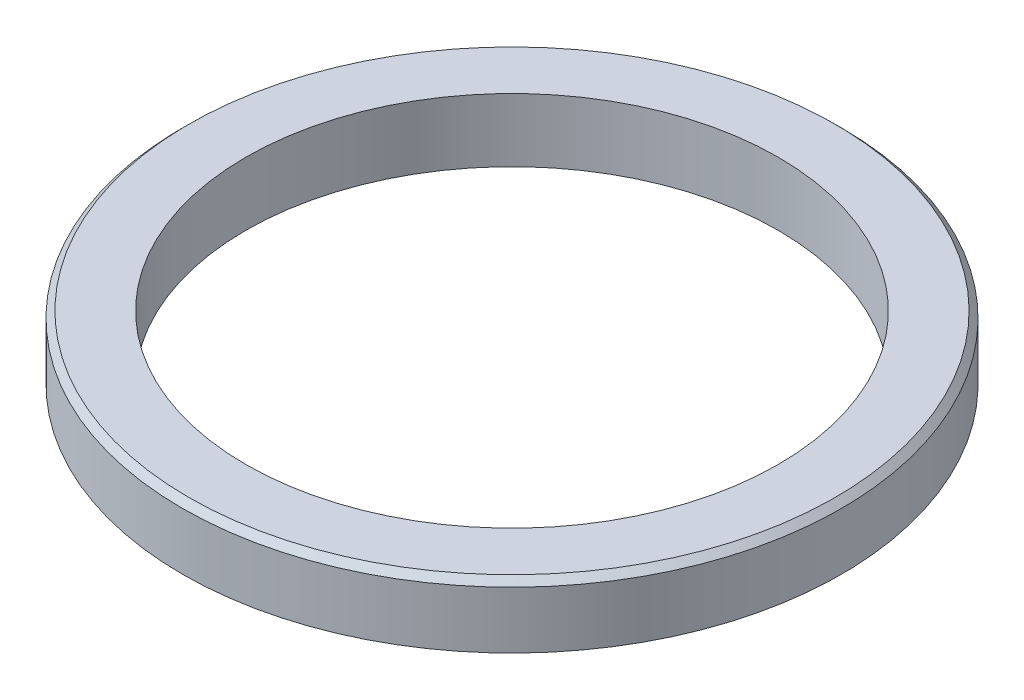
ISO-10303-21;
HEADER;
FILE_DESCRIPTION(('STEP AP214'),'2;1');
FILE_NAME('part.step','',(''),(''),'','','');
FILE_SCHEMA(('AUTOMOTIVE_DESIGN { 1 0 10303 214 1 1 1 1 }'));
ENDSEC;
DATA;
#1=APPLICATION_CONTEXT('core data for automotive mechanical design processes');
#2=APPLICATION_PROTOCOL_DEFINITION('international standard','automotive_design',2000,#1);
#3=PRODUCT_CONTEXT('',#1,'mechanical');
#4=PRODUCT('Part','Part','',(#3));
#5=PRODUCT_RELATED_PRODUCT_CATEGORY('part','',(#4));
#6=PRODUCT_DEFINITION_FORMATION('','',#4);
#7=PRODUCT_DEFINITION_CONTEXT('part definition',#1,'design');
#8=PRODUCT_DEFINITION('design','',#6,#7);
#9=PRODUCT_DEFINITION_SHAPE('','',#8);
#10=(LENGTH_UNIT() NAMED_UNIT(*) SI_UNIT(.MILLI.,.METRE.));
#11=(NAMED_UNIT(*) PLANE_ANGLE_UNIT() SI_UNIT($,.RADIAN.));
#12=(NAMED_UNIT(*) SI_UNIT($,.STERADIAN.) SOLID_ANGLE_UNIT());
#13=UNCERTAINTY_MEASURE_WITH_UNIT(LENGTH_MEASURE(1.E-05),#10,'distance_accuracy_value','');
#14=(GEOMETRIC_REPRESENTATION_CONTEXT(3) GLOBAL_UNCERTAINTY_ASSIGNED_CONTEXT((#13)) GLOBAL_UNIT_ASSIGNED_CONTEXT((#10,
#11,#12)) REPRESENTATION_CONTEXT('',''));
#15=CARTESIAN_POINT('',(0.,0.,0.));
#16=DIRECTION('',(0.,0.,1.));
#17=DIRECTION('',(1.,0.,0.));
#18=AXIS2_PLACEMENT_3D('',#15,#16,#17);
#19=CARTESIAN_POINT('',(0.,5.,0.));
#20=DIRECTION('',(0.,-1.,0.));
#21=DIRECTION('',(0.,0.,-1.));
#22=AXIS2_PLACEMENT_3D('',#19,#20,#21);
#23=CYLINDRICAL_SURFACE('',#22,26.);
#24=CARTESIAN_POINT('',(0.,4.50000000000001,0.));
#25=DIRECTION('',(0.,1.,0.));
#26=DIRECTION('',(0.,0.,1.));
#27=AXIS2_PLACEMENT_3D('',#24,#25,#26);
#28=CIRCLE('',#27,26.);
#29=CARTESIAN_POINT('',(0.,4.50000000000001,26.));
#30=VERTEX_POINT('',#29);
#31=EDGE_CURVE('E10',#30,#30,#28,.F.);
#32=ORIENTED_EDGE('',*,*,#31,.T.);
#33=EDGE_LOOP('',(#32));
#34=FACE_BOUND('',#33,.T.);
#35=CARTESIAN_POINT('',(0.,0.,0.));
#36=DIRECTION('',(0.,1.,0.));
#37=DIRECTION('',(0.,0.,1.));
#38=AXIS2_PLACEMENT_3D('',#35,#36,#37);
#39=CIRCLE('',#38,26.);
#40=CARTESIAN_POINT('',(0.,0.,26.));
#41=VERTEX_POINT('',#40);
#42=EDGE_CURVE('E53',#41,#41,#39,.T.);
#43=ORIENTED_EDGE('',*,*,#42,.T.);
#44=EDGE_LOOP('',(#43));
#45=FACE_BOUND('',#44,.T.);
#46=ADVANCED_FACE('F38',(#34,#45),#23,.T.);
#47=CARTESIAN_POINT('',(0.,5.,0.));
#48=DIRECTION('',(0.,1.,0.));
#49=DIRECTION('',(0.,0.,1.));
#50=AXIS2_PLACEMENT_3D('',#47,#48,#49);
#51=PLANE('',#50);
#52=CARTESIAN_POINT('',(0.,5.,0.));
#53=DIRECTION('',(0.,1.,0.));
#54=DIRECTION('',(0.,0.,1.));
#55=AXIS2_PLACEMENT_3D('',#52,#53,#54);
#56=CIRCLE('',#55,21.);
#57=CARTESIAN_POINT('',(0.,5.,21.));
#58=VERTEX_POINT('',#57);
#59=EDGE_CURVE('E59',#58,#58,#56,.T.);
#60=ORIENTED_EDGE('',*,*,#59,.F.);
#61=EDGE_LOOP('',(#60));
#62=FACE_BOUND('',#61,.T.);
#63=CARTESIAN_POINT('',(0.,5.,0.));
#64=DIRECTION('',(0.,1.,0.));
#65=DIRECTION('',(0.,0.,1.));
#66=AXIS2_PLACEMENT_3D('',#63,#64,#65);
#67=CIRCLE('',#66,25.5);
#68=CARTESIAN_POINT('',(0.,5.,25.5));
#69=VERTEX_POINT('',#68);
#70=EDGE_CURVE('E48',#69,#69,#67,.T.);
#71=ORIENTED_EDGE('',*,*,#70,.T.);
#72=EDGE_LOOP('',(#71));
#73=FACE_BOUND('',#72,.T.);
#74=ADVANCED_FACE('F80',(#62,#73),#51,.T.);
#75=CARTESIAN_POINT('',(0.,0.,0.));
#76=DIRECTION('',(0.,1.,0.));
#77=DIRECTION('',(0.,0.,1.));
#78=AXIS2_PLACEMENT_3D('',#75,#76,#77);
#79=PLANE('',#78);
#80=CARTESIAN_POINT('',(0.,0.,0.));
#81=DIRECTION('',(0.,1.,0.));
#82=DIRECTION('',(0.,0.,1.));
#83=AXIS2_PLACEMENT_3D('',#80,#81,#82);
#84=CIRCLE('',#83,21.);
#85=CARTESIAN_POINT('',(0.,0.,21.));
#86=VERTEX_POINT('',#85);
#87=EDGE_CURVE('E43',#86,#86,#84,.T.);
#88=ORIENTED_EDGE('',*,*,#87,.T.);
#89=EDGE_LOOP('',(#88));
#90=FACE_BOUND('',#89,.T.);
#91=ORIENTED_EDGE('',*,*,#42,.F.);
#92=EDGE_LOOP('',(#91));
#93=FACE_BOUND('',#92,.T.);
#94=ADVANCED_FACE('F68',(#90,#93),#79,.F.);
#95=CARTESIAN_POINT('',(0.,5.,0.));
#96=DIRECTION('',(0.,-1.,0.));
#97=DIRECTION('',(0.,0.,-1.));
#98=AXIS2_PLACEMENT_3D('',#95,#96,#97);
#99=CONICAL_SURFACE('',#98,25.5,0.785398163397452);
#100=ORIENTED_EDGE('',*,*,#31,.F.);
#101=EDGE_LOOP('',(#100));
#102=FACE_BOUND('',#101,.T.);
#103=ORIENTED_EDGE('',*,*,#70,.F.);
#104=EDGE_LOOP('',(#103));
#105=FACE_BOUND('',#104,.T.);
#106=ADVANCED_FACE('F41',(#102,#105),#99,.T.);
#107=CARTESIAN_POINT('',(0.,-5.,0.));
#108=DIRECTION('',(0.,1.,0.));
#109=DIRECTION('',(0.,0.,1.));
#110=AXIS2_PLACEMENT_3D('',#107,#108,#109);
#111=CYLINDRICAL_SURFACE('',#110,21.);
#112=ORIENTED_EDGE('',*,*,#59,.T.);
#113=EDGE_LOOP('',(#112));
#114=FACE_BOUND('',#113,.T.);
#115=ORIENTED_EDGE('',*,*,#87,.F.);
#116=EDGE_LOOP('',(#115));
#117=FACE_BOUND('',#116,.T.);
#118=ADVANCED_FACE('F71',(#114,#117),#111,.F.);
#119=CLOSED_SHELL('',(#46,#74,#94,#106,#118));
#120=MANIFOLD_SOLID_BREP('B2',#119);
#121=ADVANCED_BREP_SHAPE_REPRESENTATION('',(#18,#120),#14);
#122=SHAPE_DEFINITION_REPRESENTATION(#9,#121);
ENDSEC;
END-ISO-10303-21;
